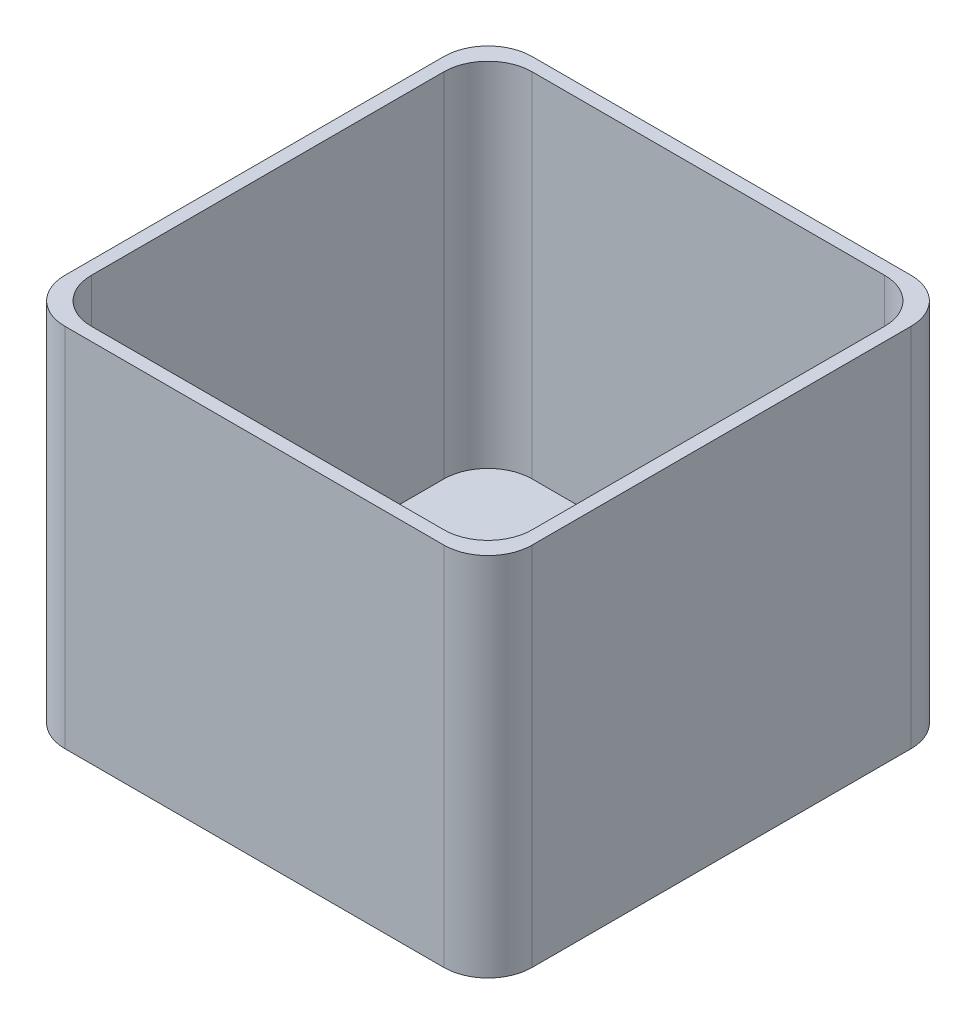
ISO-10303-21;
HEADER;
FILE_DESCRIPTION(('STEP AP214'),'2;1');
FILE_NAME('part.step','',(''),(''),'','','');
FILE_SCHEMA(('AUTOMOTIVE_DESIGN { 1 0 10303 214 1 1 1 1 }'));
ENDSEC;
DATA;
#1=APPLICATION_CONTEXT('core data for automotive mechanical design processes');
#2=APPLICATION_PROTOCOL_DEFINITION('international standard','automotive_design',2000,#1);
#3=PRODUCT_CONTEXT('',#1,'mechanical');
#4=PRODUCT('Part','Part','',(#3));
#5=PRODUCT_RELATED_PRODUCT_CATEGORY('part','',(#4));
#6=PRODUCT_DEFINITION_FORMATION('','',#4);
#7=PRODUCT_DEFINITION_CONTEXT('part definition',#1,'design');
#8=PRODUCT_DEFINITION('design','',#6,#7);
#9=PRODUCT_DEFINITION_SHAPE('','',#8);
#10=(LENGTH_UNIT() NAMED_UNIT(*) SI_UNIT(.MILLI.,.METRE.));
#11=(NAMED_UNIT(*) PLANE_ANGLE_UNIT() SI_UNIT($,.RADIAN.));
#12=(NAMED_UNIT(*) SI_UNIT($,.STERADIAN.) SOLID_ANGLE_UNIT());
#13=UNCERTAINTY_MEASURE_WITH_UNIT(LENGTH_MEASURE(1.E-05),#10,'distance_accuracy_value','');
#14=(GEOMETRIC_REPRESENTATION_CONTEXT(3) GLOBAL_UNCERTAINTY_ASSIGNED_CONTEXT((#13)) GLOBAL_UNIT_ASSIGNED_CONTEXT((#10,
#11,#12)) REPRESENTATION_CONTEXT('',''));
#15=CARTESIAN_POINT('',(0.,0.,0.));
#16=DIRECTION('',(0.,0.,1.));
#17=DIRECTION('',(1.,0.,0.));
#18=AXIS2_PLACEMENT_3D('',#15,#16,#17);
#19=CARTESIAN_POINT('',(0.,80.,-18.3578680203046));
#20=DIRECTION('',(0.,0.,-1.));
#21=DIRECTION('',(-1.,0.,0.));
#22=AXIS2_PLACEMENT_3D('',#19,#20,#21);
#23=PLANE('',#22);
#24=DIRECTION('',(1.,0.,0.));
#25=VECTOR('',#24,1.);
#26=CARTESIAN_POINT('',(0.,0.,-18.3578680203046));
#27=LINE('',#26,#25);
#28=CARTESIAN_POINT('',(-70.8781725888324,0.,-18.3578680203046));
#29=VERTEX_POINT('',#28);
#30=CARTESIAN_POINT('',(9.12182741116744,0.,-18.3578680203046));
#31=VERTEX_POINT('',#30);
#32=EDGE_CURVE('E206',#29,#31,#27,.T.);
#33=ORIENTED_EDGE('',*,*,#32,.T.);
#34=DIRECTION('',(0.,-1.,0.));
#35=VECTOR('',#34,1.);
#36=CARTESIAN_POINT('',(9.12182741116744,80.,-18.3578680203046));
#37=LINE('',#36,#35);
#38=CARTESIAN_POINT('',(9.12182741116744,80.,-18.3578680203046));
#39=VERTEX_POINT('',#38);
#40=EDGE_CURVE('E11',#39,#31,#37,.T.);
#41=ORIENTED_EDGE('',*,*,#40,.F.);
#42=DIRECTION('',(1.,0.,0.));
#43=VECTOR('',#42,1.);
#44=CARTESIAN_POINT('',(0.,80.,-18.3578680203046));
#45=LINE('',#44,#43);
#46=CARTESIAN_POINT('',(-70.8781725888324,80.,-18.3578680203046));
#47=VERTEX_POINT('',#46);
#48=EDGE_CURVE('E237',#47,#39,#45,.T.);
#49=ORIENTED_EDGE('',*,*,#48,.F.);
#50=DIRECTION('',(0.,-1.,0.));
#51=VECTOR('',#50,1.);
#52=CARTESIAN_POINT('',(-70.8781725888324,80.,-18.3578680203046));
#53=LINE('',#52,#51);
#54=EDGE_CURVE('E163',#47,#29,#53,.T.);
#55=ORIENTED_EDGE('',*,*,#54,.T.);
#56=EDGE_LOOP('',(#33,#41,#49,#55));
#57=FACE_BOUND('',#56,.T.);
#58=ADVANCED_FACE('F41',(#57),#23,.F.);
#59=CARTESIAN_POINT('',(9.12182741116751,80.,-8.3578680203046));
#60=DIRECTION('',(0.,-1.,0.));
#61=DIRECTION('',(0.,0.,-1.));
#62=AXIS2_PLACEMENT_3D('',#59,#60,#61);
#63=CYLINDRICAL_SURFACE('',#62,10.);
#64=CARTESIAN_POINT('',(9.12182741116751,0.,-8.3578680203046));
#65=DIRECTION('',(0.,1.,0.));
#66=DIRECTION('',(0.,0.,1.));
#67=AXIS2_PLACEMENT_3D('',#64,#65,#66);
#68=CIRCLE('',#67,10.);
#69=CARTESIAN_POINT('',(19.1218274111675,0.,-8.35786802030453));
#70=VERTEX_POINT('',#69);
#71=EDGE_CURVE('E266',#31,#70,#68,.F.);
#72=ORIENTED_EDGE('',*,*,#71,.T.);
#73=DIRECTION('',(0.,-1.,0.));
#74=VECTOR('',#73,1.);
#75=CARTESIAN_POINT('',(19.1218274111675,80.,-8.35786802030453));
#76=LINE('',#75,#74);
#77=CARTESIAN_POINT('',(19.1218274111675,80.,-8.35786802030453));
#78=VERTEX_POINT('',#77);
#79=EDGE_CURVE('E52',#78,#70,#76,.T.);
#80=ORIENTED_EDGE('',*,*,#79,.F.);
#81=CARTESIAN_POINT('',(9.12182741116751,80.,-8.3578680203046));
#82=DIRECTION('',(0.,1.,0.));
#83=DIRECTION('',(0.,0.,1.));
#84=AXIS2_PLACEMENT_3D('',#81,#82,#83);
#85=CIRCLE('',#84,10.);
#86=EDGE_CURVE('E240',#39,#78,#85,.F.);
#87=ORIENTED_EDGE('',*,*,#86,.F.);
#88=ORIENTED_EDGE('',*,*,#40,.T.);
#89=EDGE_LOOP('',(#72,#80,#87,#88));
#90=FACE_BOUND('',#89,.T.);
#91=ADVANCED_FACE('F370',(#90),#63,.F.);
#92=CARTESIAN_POINT('',(19.1218274111675,80.,0.));
#93=DIRECTION('',(-1.,0.,0.));
#94=DIRECTION('',(0.,0.,1.));
#95=AXIS2_PLACEMENT_3D('',#92,#93,#94);
#96=PLANE('',#95);
#97=DIRECTION('',(0.,0.,-1.));
#98=VECTOR('',#97,1.);
#99=CARTESIAN_POINT('',(19.1218274111675,0.,0.));
#100=LINE('',#99,#98);
#101=CARTESIAN_POINT('',(19.1218274111675,0.,71.6421319796953));
#102=VERTEX_POINT('',#101);
#103=EDGE_CURVE('E270',#102,#70,#100,.T.);
#104=ORIENTED_EDGE('',*,*,#103,.F.);
#105=DIRECTION('',(0.,-1.,0.));
#106=VECTOR('',#105,1.);
#107=CARTESIAN_POINT('',(19.1218274111675,80.,71.6421319796953));
#108=LINE('',#107,#106);
#109=CARTESIAN_POINT('',(19.1218274111675,80.,71.6421319796953));
#110=VERTEX_POINT('',#109);
#111=EDGE_CURVE('E310',#110,#102,#108,.T.);
#112=ORIENTED_EDGE('',*,*,#111,.F.);
#113=DIRECTION('',(0.,0.,-1.));
#114=VECTOR('',#113,1.);
#115=CARTESIAN_POINT('',(19.1218274111675,80.,0.));
#116=LINE('',#115,#114);
#117=EDGE_CURVE('E243',#110,#78,#116,.T.);
#118=ORIENTED_EDGE('',*,*,#117,.T.);
#119=ORIENTED_EDGE('',*,*,#79,.T.);
#120=EDGE_LOOP('',(#104,#112,#118,#119));
#121=FACE_BOUND('',#120,.T.);
#122=ADVANCED_FACE('F376',(#121),#96,.T.);
#123=CARTESIAN_POINT('',(9.12182741116751,80.,71.6421319796954));
#124=DIRECTION('',(0.,-1.,0.));
#125=DIRECTION('',(0.,0.,-1.));
#126=AXIS2_PLACEMENT_3D('',#123,#124,#125);
#127=CYLINDRICAL_SURFACE('',#126,10.);
#128=CARTESIAN_POINT('',(9.12182741116751,0.,71.6421319796954));
#129=DIRECTION('',(0.,1.,0.));
#130=DIRECTION('',(0.,0.,1.));
#131=AXIS2_PLACEMENT_3D('',#128,#129,#130);
#132=CIRCLE('',#131,10.);
#133=CARTESIAN_POINT('',(9.12182741116744,0.,81.6421319796954));
#134=VERTEX_POINT('',#133);
#135=EDGE_CURVE('E274',#134,#102,#132,.T.);
#136=ORIENTED_EDGE('',*,*,#135,.F.);
#137=DIRECTION('',(0.,-1.,0.));
#138=VECTOR('',#137,1.);
#139=CARTESIAN_POINT('',(9.12182741116744,80.,81.6421319796954));
#140=LINE('',#139,#138);
#141=CARTESIAN_POINT('',(9.12182741116744,80.,81.6421319796954));
#142=VERTEX_POINT('',#141);
#143=EDGE_CURVE('E306',#142,#134,#140,.T.);
#144=ORIENTED_EDGE('',*,*,#143,.F.);
#145=CARTESIAN_POINT('',(9.12182741116751,80.,71.6421319796954));
#146=DIRECTION('',(0.,1.,0.));
#147=DIRECTION('',(0.,0.,1.));
#148=AXIS2_PLACEMENT_3D('',#145,#146,#147);
#149=CIRCLE('',#148,10.);
#150=EDGE_CURVE('E247',#142,#110,#149,.T.);
#151=ORIENTED_EDGE('',*,*,#150,.T.);
#152=ORIENTED_EDGE('',*,*,#111,.T.);
#153=EDGE_LOOP('',(#136,#144,#151,#152));
#154=FACE_BOUND('',#153,.T.);
#155=ADVANCED_FACE('F531',(#154),#127,.F.);
#156=CARTESIAN_POINT('',(0.,80.,81.6421319796954));
#157=DIRECTION('',(0.,0.,-1.));
#158=DIRECTION('',(-1.,0.,0.));
#159=AXIS2_PLACEMENT_3D('',#156,#157,#158);
#160=PLANE('',#159);
#161=DIRECTION('',(1.,0.,0.));
#162=VECTOR('',#161,1.);
#163=CARTESIAN_POINT('',(0.,0.,81.6421319796954));
#164=LINE('',#163,#162);
#165=CARTESIAN_POINT('',(-70.8781725888324,0.,81.6421319796954));
#166=VERTEX_POINT('',#165);
#167=EDGE_CURVE('E277',#166,#134,#164,.T.);
#168=ORIENTED_EDGE('',*,*,#167,.F.);
#169=DIRECTION('',(0.,-1.,0.));
#170=VECTOR('',#169,1.);
#171=CARTESIAN_POINT('',(-70.8781725888324,80.,81.6421319796954));
#172=LINE('',#171,#170);
#173=CARTESIAN_POINT('',(-70.8781725888324,80.,81.6421319796954));
#174=VERTEX_POINT('',#173);
#175=EDGE_CURVE('E302',#174,#166,#172,.T.);
#176=ORIENTED_EDGE('',*,*,#175,.F.);
#177=DIRECTION('',(1.,0.,0.));
#178=VECTOR('',#177,1.);
#179=CARTESIAN_POINT('',(0.,80.,81.6421319796954));
#180=LINE('',#179,#178);
#181=EDGE_CURVE('E251',#174,#142,#180,.T.);
#182=ORIENTED_EDGE('',*,*,#181,.T.);
#183=ORIENTED_EDGE('',*,*,#143,.T.);
#184=EDGE_LOOP('',(#168,#176,#182,#183));
#185=FACE_BOUND('',#184,.T.);
#186=ADVANCED_FACE('F521',(#185),#160,.T.);
#187=CARTESIAN_POINT('',(-70.8781725888325,80.,71.6421319796954));
#188=DIRECTION('',(0.,-1.,0.));
#189=DIRECTION('',(0.,0.,-1.));
#190=AXIS2_PLACEMENT_3D('',#187,#188,#189);
#191=CYLINDRICAL_SURFACE('',#190,9.99999999999999);
#192=CARTESIAN_POINT('',(-70.8781725888325,0.,71.6421319796954));
#193=DIRECTION('',(0.,1.,0.));
#194=DIRECTION('',(0.,0.,1.));
#195=AXIS2_PLACEMENT_3D('',#192,#193,#194);
#196=CIRCLE('',#195,9.99999999999999);
#197=CARTESIAN_POINT('',(-80.8781725888325,0.,71.6421319796953));
#198=VERTEX_POINT('',#197);
#199=EDGE_CURVE('E280',#166,#198,#196,.F.);
#200=ORIENTED_EDGE('',*,*,#199,.T.);
#201=DIRECTION('',(0.,-1.,0.));
#202=VECTOR('',#201,1.);
#203=CARTESIAN_POINT('',(-80.8781725888325,80.,71.6421319796953));
#204=LINE('',#203,#202);
#205=CARTESIAN_POINT('',(-80.8781725888325,80.,71.6421319796953));
#206=VERTEX_POINT('',#205);
#207=EDGE_CURVE('E298',#206,#198,#204,.T.);
#208=ORIENTED_EDGE('',*,*,#207,.F.);
#209=CARTESIAN_POINT('',(-70.8781725888325,80.,71.6421319796954));
#210=DIRECTION('',(0.,1.,0.));
#211=DIRECTION('',(0.,0.,1.));
#212=AXIS2_PLACEMENT_3D('',#209,#210,#211);
#213=CIRCLE('',#212,9.99999999999999);
#214=EDGE_CURVE('E255',#174,#206,#213,.F.);
#215=ORIENTED_EDGE('',*,*,#214,.F.);
#216=ORIENTED_EDGE('',*,*,#175,.T.);
#217=EDGE_LOOP('',(#200,#208,#215,#216));
#218=FACE_BOUND('',#217,.T.);
#219=ADVANCED_FACE('F511',(#218),#191,.F.);
#220=CARTESIAN_POINT('',(-80.8781725888325,80.,0.));
#221=DIRECTION('',(-1.,0.,0.));
#222=DIRECTION('',(0.,0.,1.));
#223=AXIS2_PLACEMENT_3D('',#220,#221,#222);
#224=PLANE('',#223);
#225=DIRECTION('',(0.,0.,-1.));
#226=VECTOR('',#225,1.);
#227=CARTESIAN_POINT('',(-80.8781725888325,0.,0.));
#228=LINE('',#227,#226);
#229=CARTESIAN_POINT('',(-80.8781725888325,0.,-8.35786802030452));
#230=VERTEX_POINT('',#229);
#231=EDGE_CURVE('E284',#198,#230,#228,.T.);
#232=ORIENTED_EDGE('',*,*,#231,.T.);
#233=DIRECTION('',(0.,-1.,0.));
#234=VECTOR('',#233,1.);
#235=CARTESIAN_POINT('',(-80.8781725888325,80.,-8.35786802030452));
#236=LINE('',#235,#234);
#237=CARTESIAN_POINT('',(-80.8781725888325,80.,-8.35786802030452));
#238=VERTEX_POINT('',#237);
#239=EDGE_CURVE('E294',#238,#230,#236,.T.);
#240=ORIENTED_EDGE('',*,*,#239,.F.);
#241=DIRECTION('',(0.,0.,-1.));
#242=VECTOR('',#241,1.);
#243=CARTESIAN_POINT('',(-80.8781725888325,80.,0.));
#244=LINE('',#243,#242);
#245=EDGE_CURVE('E258',#206,#238,#244,.T.);
#246=ORIENTED_EDGE('',*,*,#245,.F.);
#247=ORIENTED_EDGE('',*,*,#207,.T.);
#248=EDGE_LOOP('',(#232,#240,#246,#247));
#249=FACE_BOUND('',#248,.T.);
#250=ADVANCED_FACE('F502',(#249),#224,.F.);
#251=CARTESIAN_POINT('',(-73.8781725888325,80.,-11.3578680203046));
#252=DIRECTION('',(0.,-1.,0.));
#253=DIRECTION('',(0.,0.,-1.));
#254=AXIS2_PLACEMENT_3D('',#251,#252,#253);
#255=CYLINDRICAL_SURFACE('',#254,10.);
#256=DIRECTION('',(0.,-1.,0.));
#257=VECTOR('',#256,1.);
#258=CARTESIAN_POINT('',(-73.8781725888324,80.,-21.3578680203046));
#259=LINE('',#258,#257);
#260=CARTESIAN_POINT('',(-73.8781725888324,80.,-21.3578680203046));
#261=VERTEX_POINT('',#260);
#262=CARTESIAN_POINT('',(-73.8781725888324,-3.,-21.3578680203046));
#263=VERTEX_POINT('',#262);
#264=EDGE_CURVE('E167',#261,#263,#259,.T.);
#265=ORIENTED_EDGE('',*,*,#264,.T.);
#266=CARTESIAN_POINT('',(-73.8781725888325,-3.,-11.3578680203046));
#267=DIRECTION('',(0.,-1.,0.));
#268=DIRECTION('',(0.,0.,-1.));
#269=AXIS2_PLACEMENT_3D('',#266,#267,#268);
#270=CIRCLE('',#269,10.);
#271=CARTESIAN_POINT('',(-83.8781725888325,-3.,-11.3578680203045));
#272=VERTEX_POINT('',#271);
#273=EDGE_CURVE('E166',#272,#263,#270,.T.);
#274=ORIENTED_EDGE('',*,*,#273,.F.);
#275=DIRECTION('',(0.,-1.,0.));
#276=VECTOR('',#275,1.);
#277=CARTESIAN_POINT('',(-83.8781725888325,80.,-11.3578680203045));
#278=LINE('',#277,#276);
#279=CARTESIAN_POINT('',(-83.8781725888325,80.,-11.3578680203045));
#280=VERTEX_POINT('',#279);
#281=EDGE_CURVE('E45',#280,#272,#278,.T.);
#282=ORIENTED_EDGE('',*,*,#281,.F.);
#283=CARTESIAN_POINT('',(-73.8781725888325,80.,-11.3578680203046));
#284=DIRECTION('',(0.,1.,0.));
#285=DIRECTION('',(0.,0.,1.));
#286=AXIS2_PLACEMENT_3D('',#283,#284,#285);
#287=CIRCLE('',#286,10.);
#288=EDGE_CURVE('E210',#280,#261,#287,.F.);
#289=ORIENTED_EDGE('',*,*,#288,.T.);
#290=EDGE_LOOP('',(#265,#274,#282,#289));
#291=FACE_BOUND('',#290,.T.);
#292=ADVANCED_FACE('F43',(#291),#255,.T.);
#293=CARTESIAN_POINT('',(-83.8781725888325,80.,0.));
#294=DIRECTION('',(-1.,0.,0.));
#295=DIRECTION('',(0.,0.,1.));
#296=AXIS2_PLACEMENT_3D('',#293,#294,#295);
#297=PLANE('',#296);
#298=ORIENTED_EDGE('',*,*,#281,.T.);
#299=DIRECTION('',(0.,0.,-1.));
#300=VECTOR('',#299,1.);
#301=CARTESIAN_POINT('',(-83.8781725888325,-3.,0.));
#302=LINE('',#301,#300);
#303=CARTESIAN_POINT('',(-83.8781725888325,-3.,74.6421319796953));
#304=VERTEX_POINT('',#303);
#305=EDGE_CURVE('E156',#304,#272,#302,.T.);
#306=ORIENTED_EDGE('',*,*,#305,.F.);
#307=DIRECTION('',(0.,-1.,0.));
#308=VECTOR('',#307,1.);
#309=CARTESIAN_POINT('',(-83.8781725888325,80.,74.6421319796953));
#310=LINE('',#309,#308);
#311=CARTESIAN_POINT('',(-83.8781725888325,80.,74.6421319796953));
#312=VERTEX_POINT('',#311);
#313=EDGE_CURVE('E164',#312,#304,#310,.T.);
#314=ORIENTED_EDGE('',*,*,#313,.F.);
#315=DIRECTION('',(0.,0.,-1.));
#316=VECTOR('',#315,1.);
#317=CARTESIAN_POINT('',(-83.8781725888325,80.,0.));
#318=LINE('',#317,#316);
#319=EDGE_CURVE('E158',#312,#280,#318,.T.);
#320=ORIENTED_EDGE('',*,*,#319,.T.);
#321=EDGE_LOOP('',(#298,#306,#314,#320));
#322=FACE_BOUND('',#321,.T.);
#323=ADVANCED_FACE('F154',(#322),#297,.T.);
#324=CARTESIAN_POINT('',(-73.8781725888325,80.,74.6421319796954));
#325=DIRECTION('',(0.,-1.,0.));
#326=DIRECTION('',(0.,0.,-1.));
#327=AXIS2_PLACEMENT_3D('',#324,#325,#326);
#328=CYLINDRICAL_SURFACE('',#327,9.99999999999999);
#329=ORIENTED_EDGE('',*,*,#313,.T.);
#330=CARTESIAN_POINT('',(-73.8781725888325,-3.,74.6421319796954));
#331=DIRECTION('',(0.,-1.,0.));
#332=DIRECTION('',(0.,0.,-1.));
#333=AXIS2_PLACEMENT_3D('',#330,#331,#332);
#334=CIRCLE('',#333,9.99999999999999);
#335=CARTESIAN_POINT('',(-73.8781725888324,-3.,84.6421319796954));
#336=VERTEX_POINT('',#335);
#337=EDGE_CURVE('E178',#336,#304,#334,.T.);
#338=ORIENTED_EDGE('',*,*,#337,.F.);
#339=DIRECTION('',(0.,-1.,0.));
#340=VECTOR('',#339,1.);
#341=CARTESIAN_POINT('',(-73.8781725888324,80.,84.6421319796954));
#342=LINE('',#341,#340);
#343=CARTESIAN_POINT('',(-73.8781725888324,80.,84.6421319796954));
#344=VERTEX_POINT('',#343);
#345=EDGE_CURVE('E331',#344,#336,#342,.T.);
#346=ORIENTED_EDGE('',*,*,#345,.F.);
#347=CARTESIAN_POINT('',(-73.8781725888325,80.,74.6421319796954));
#348=DIRECTION('',(0.,1.,0.));
#349=DIRECTION('',(0.,0.,1.));
#350=AXIS2_PLACEMENT_3D('',#347,#348,#349);
#351=CIRCLE('',#350,9.99999999999999);
#352=EDGE_CURVE('E216',#344,#312,#351,.F.);
#353=ORIENTED_EDGE('',*,*,#352,.T.);
#354=EDGE_LOOP('',(#329,#338,#346,#353));
#355=FACE_BOUND('',#354,.T.);
#356=ADVANCED_FACE('F335',(#355),#328,.T.);
#357=CARTESIAN_POINT('',(0.,80.,84.6421319796954));
#358=DIRECTION('',(0.,0.,-1.));
#359=DIRECTION('',(-1.,0.,0.));
#360=AXIS2_PLACEMENT_3D('',#357,#358,#359);
#361=PLANE('',#360);
#362=ORIENTED_EDGE('',*,*,#345,.T.);
#363=DIRECTION('',(-1.,0.,0.));
#364=VECTOR('',#363,1.);
#365=CARTESIAN_POINT('',(0.,-3.,84.6421319796954));
#366=LINE('',#365,#364);
#367=CARTESIAN_POINT('',(12.1218274111674,-3.,84.6421319796954));
#368=VERTEX_POINT('',#367);
#369=EDGE_CURVE('E201',#368,#336,#366,.T.);
#370=ORIENTED_EDGE('',*,*,#369,.F.);
#371=DIRECTION('',(0.,-1.,0.));
#372=VECTOR('',#371,1.);
#373=CARTESIAN_POINT('',(12.1218274111674,80.,84.6421319796954));
#374=LINE('',#373,#372);
#375=CARTESIAN_POINT('',(12.1218274111674,80.,84.6421319796954));
#376=VERTEX_POINT('',#375);
#377=EDGE_CURVE('E328',#376,#368,#374,.T.);
#378=ORIENTED_EDGE('',*,*,#377,.F.);
#379=DIRECTION('',(1.,0.,0.));
#380=VECTOR('',#379,1.);
#381=CARTESIAN_POINT('',(0.,80.,84.6421319796954));
#382=LINE('',#381,#380);
#383=EDGE_CURVE('E220',#344,#376,#382,.T.);
#384=ORIENTED_EDGE('',*,*,#383,.F.);
#385=EDGE_LOOP('',(#362,#370,#378,#384));
#386=FACE_BOUND('',#385,.T.);
#387=ADVANCED_FACE('F360',(#386),#361,.F.);
#388=CARTESIAN_POINT('',(12.1218274111675,80.,74.6421319796954));
#389=DIRECTION('',(0.,-1.,0.));
#390=DIRECTION('',(0.,0.,-1.));
#391=AXIS2_PLACEMENT_3D('',#388,#389,#390);
#392=CYLINDRICAL_SURFACE('',#391,10.);
#393=ORIENTED_EDGE('',*,*,#377,.T.);
#394=CARTESIAN_POINT('',(12.1218274111675,-3.,74.6421319796954));
#395=DIRECTION('',(0.,-1.,0.));
#396=DIRECTION('',(0.,0.,-1.));
#397=AXIS2_PLACEMENT_3D('',#394,#395,#396);
#398=CIRCLE('',#397,10.);
#399=CARTESIAN_POINT('',(22.1218274111675,-3.,74.6421319796953));
#400=VERTEX_POINT('',#399);
#401=EDGE_CURVE('E197',#400,#368,#398,.T.);
#402=ORIENTED_EDGE('',*,*,#401,.F.);
#403=DIRECTION('',(0.,-1.,0.));
#404=VECTOR('',#403,1.);
#405=CARTESIAN_POINT('',(22.1218274111675,80.,74.6421319796953));
#406=LINE('',#405,#404);
#407=CARTESIAN_POINT('',(22.1218274111675,80.,74.6421319796953));
#408=VERTEX_POINT('',#407);
#409=EDGE_CURVE('E325',#408,#400,#406,.T.);
#410=ORIENTED_EDGE('',*,*,#409,.F.);
#411=CARTESIAN_POINT('',(12.1218274111675,80.,74.6421319796954));
#412=DIRECTION('',(0.,1.,0.));
#413=DIRECTION('',(0.,0.,1.));
#414=AXIS2_PLACEMENT_3D('',#411,#412,#413);
#415=CIRCLE('',#414,10.);
#416=EDGE_CURVE('E223',#376,#408,#415,.T.);
#417=ORIENTED_EDGE('',*,*,#416,.F.);
#418=EDGE_LOOP('',(#393,#402,#410,#417));
#419=FACE_BOUND('',#418,.T.);
#420=ADVANCED_FACE('F355',(#419),#392,.T.);
#421=CARTESIAN_POINT('',(22.1218274111675,80.,0.));
#422=DIRECTION('',(-1.,0.,0.));
#423=DIRECTION('',(0.,0.,1.));
#424=AXIS2_PLACEMENT_3D('',#421,#422,#423);
#425=PLANE('',#424);
#426=ORIENTED_EDGE('',*,*,#409,.T.);
#427=DIRECTION('',(0.,0.,1.));
#428=VECTOR('',#427,1.);
#429=CARTESIAN_POINT('',(22.1218274111675,-3.,0.));
#430=LINE('',#429,#428);
#431=CARTESIAN_POINT('',(22.1218274111675,-3.,-11.3578680203045));
#432=VERTEX_POINT('',#431);
#433=EDGE_CURVE('E193',#432,#400,#430,.T.);
#434=ORIENTED_EDGE('',*,*,#433,.F.);
#435=DIRECTION('',(0.,-1.,0.));
#436=VECTOR('',#435,1.);
#437=CARTESIAN_POINT('',(22.1218274111675,80.,-11.3578680203045));
#438=LINE('',#437,#436);
#439=CARTESIAN_POINT('',(22.1218274111675,80.,-11.3578680203045));
#440=VERTEX_POINT('',#439);
#441=EDGE_CURVE('E322',#440,#432,#438,.T.);
#442=ORIENTED_EDGE('',*,*,#441,.F.);
#443=DIRECTION('',(0.,0.,-1.));
#444=VECTOR('',#443,1.);
#445=CARTESIAN_POINT('',(22.1218274111675,80.,0.));
#446=LINE('',#445,#444);
#447=EDGE_CURVE('E226',#408,#440,#446,.T.);
#448=ORIENTED_EDGE('',*,*,#447,.F.);
#449=EDGE_LOOP('',(#426,#434,#442,#448));
#450=FACE_BOUND('',#449,.T.);
#451=ADVANCED_FACE('F350',(#450),#425,.F.);
#452=CARTESIAN_POINT('',(12.1218274111675,80.,-11.3578680203046));
#453=DIRECTION('',(0.,-1.,0.));
#454=DIRECTION('',(0.,0.,-1.));
#455=AXIS2_PLACEMENT_3D('',#452,#453,#454);
#456=CYLINDRICAL_SURFACE('',#455,10.);
#457=ORIENTED_EDGE('',*,*,#441,.T.);
#458=CARTESIAN_POINT('',(12.1218274111675,-3.,-11.3578680203046));
#459=DIRECTION('',(0.,-1.,0.));
#460=DIRECTION('',(0.,0.,-1.));
#461=AXIS2_PLACEMENT_3D('',#458,#459,#460);
#462=CIRCLE('',#461,10.);
#463=CARTESIAN_POINT('',(12.1218274111675,-3.,-21.3578680203046));
#464=VERTEX_POINT('',#463);
#465=EDGE_CURVE('E189',#464,#432,#462,.T.);
#466=ORIENTED_EDGE('',*,*,#465,.F.);
#467=DIRECTION('',(0.,-1.,0.));
#468=VECTOR('',#467,1.);
#469=CARTESIAN_POINT('',(12.1218274111674,80.,-21.3578680203046));
#470=LINE('',#469,#468);
#471=CARTESIAN_POINT('',(12.1218274111674,80.,-21.3578680203046));
#472=VERTEX_POINT('',#471);
#473=EDGE_CURVE('E319',#472,#464,#470,.T.);
#474=ORIENTED_EDGE('',*,*,#473,.F.);
#475=CARTESIAN_POINT('',(12.1218274111675,80.,-11.3578680203046));
#476=DIRECTION('',(0.,1.,0.));
#477=DIRECTION('',(0.,0.,1.));
#478=AXIS2_PLACEMENT_3D('',#475,#476,#477);
#479=CIRCLE('',#478,10.);
#480=EDGE_CURVE('E229',#472,#440,#479,.F.);
#481=ORIENTED_EDGE('',*,*,#480,.T.);
#482=EDGE_LOOP('',(#457,#466,#474,#481));
#483=FACE_BOUND('',#482,.T.);
#484=ADVANCED_FACE('F346',(#483),#456,.T.);
#485=CARTESIAN_POINT('',(0.,80.,-21.3578680203046));
#486=DIRECTION('',(0.,0.,-1.));
#487=DIRECTION('',(-1.,0.,0.));
#488=AXIS2_PLACEMENT_3D('',#485,#486,#487);
#489=PLANE('',#488);
#490=ORIENTED_EDGE('',*,*,#473,.T.);
#491=DIRECTION('',(1.,0.,0.));
#492=VECTOR('',#491,1.);
#493=CARTESIAN_POINT('',(0.,-3.,-21.3578680203046));
#494=LINE('',#493,#492);
#495=EDGE_CURVE('E172',#263,#464,#494,.T.);
#496=ORIENTED_EDGE('',*,*,#495,.F.);
#497=ORIENTED_EDGE('',*,*,#264,.F.);
#498=DIRECTION('',(1.,0.,0.));
#499=VECTOR('',#498,1.);
#500=CARTESIAN_POINT('',(0.,80.,-21.3578680203046));
#501=LINE('',#500,#499);
#502=EDGE_CURVE('E233',#261,#472,#501,.T.);
#503=ORIENTED_EDGE('',*,*,#502,.T.);
#504=EDGE_LOOP('',(#490,#496,#497,#503));
#505=FACE_BOUND('',#504,.T.);
#506=ADVANCED_FACE('F342',(#505),#489,.T.);
#507=CARTESIAN_POINT('',(-70.8781725888325,80.,-8.35786802030459));
#508=DIRECTION('',(0.,-1.,0.));
#509=DIRECTION('',(0.,0.,-1.));
#510=AXIS2_PLACEMENT_3D('',#507,#508,#509);
#511=CYLINDRICAL_SURFACE('',#510,10.);
#512=CARTESIAN_POINT('',(-70.8781725888325,0.,-8.35786802030459));
#513=DIRECTION('',(0.,1.,0.));
#514=DIRECTION('',(0.,0.,1.));
#515=AXIS2_PLACEMENT_3D('',#512,#513,#514);
#516=CIRCLE('',#515,10.);
#517=EDGE_CURVE('E213',#230,#29,#516,.F.);
#518=ORIENTED_EDGE('',*,*,#517,.T.);
#519=ORIENTED_EDGE('',*,*,#54,.F.);
#520=CARTESIAN_POINT('',(-70.8781725888325,80.,-8.35786802030459));
#521=DIRECTION('',(0.,1.,0.));
#522=DIRECTION('',(0.,0.,1.));
#523=AXIS2_PLACEMENT_3D('',#520,#521,#522);
#524=CIRCLE('',#523,10.);
#525=EDGE_CURVE('E60',#238,#47,#524,.F.);
#526=ORIENTED_EDGE('',*,*,#525,.F.);
#527=ORIENTED_EDGE('',*,*,#239,.T.);
#528=EDGE_LOOP('',(#518,#519,#526,#527));
#529=FACE_BOUND('',#528,.T.);
#530=ADVANCED_FACE('F383',(#529),#511,.F.);
#531=CARTESIAN_POINT('',(0.,80.,0.));
#532=DIRECTION('',(0.,1.,0.));
#533=DIRECTION('',(0.,0.,1.));
#534=AXIS2_PLACEMENT_3D('',#531,#532,#533);
#535=PLANE('',#534);
#536=ORIENTED_EDGE('',*,*,#288,.F.);
#537=ORIENTED_EDGE('',*,*,#319,.F.);
#538=ORIENTED_EDGE('',*,*,#352,.F.);
#539=ORIENTED_EDGE('',*,*,#383,.T.);
#540=ORIENTED_EDGE('',*,*,#416,.T.);
#541=ORIENTED_EDGE('',*,*,#447,.T.);
#542=ORIENTED_EDGE('',*,*,#480,.F.);
#543=ORIENTED_EDGE('',*,*,#502,.F.);
#544=EDGE_LOOP('',(#536,#537,#538,#539,#540,#541,#542,#543));
#545=FACE_BOUND('',#544,.T.);
#546=ORIENTED_EDGE('',*,*,#48,.T.);
#547=ORIENTED_EDGE('',*,*,#86,.T.);
#548=ORIENTED_EDGE('',*,*,#117,.F.);
#549=ORIENTED_EDGE('',*,*,#150,.F.);
#550=ORIENTED_EDGE('',*,*,#181,.F.);
#551=ORIENTED_EDGE('',*,*,#214,.T.);
#552=ORIENTED_EDGE('',*,*,#245,.T.);
#553=ORIENTED_EDGE('',*,*,#525,.T.);
#554=EDGE_LOOP('',(#546,#547,#548,#549,#550,#551,#552,#553));
#555=FACE_BOUND('',#554,.T.);
#556=ADVANCED_FACE('F338',(#545,#555),#535,.T.);
#557=CARTESIAN_POINT('',(0.,0.,0.));
#558=DIRECTION('',(0.,-1.,0.));
#559=DIRECTION('',(0.,0.,-1.));
#560=AXIS2_PLACEMENT_3D('',#557,#558,#559);
#561=PLANE('',#560);
#562=CARTESIAN_POINT('',(13.968668106839,0.,-4.77801989746901));
#563=DIRECTION('',(0.,-1.,0.));
#564=DIRECTION('',(0.,0.,-1.));
#565=AXIS2_PLACEMENT_3D('',#562,#563,#564);
#566=CIRCLE('',#565,4.77801989746901);
#567=CARTESIAN_POINT('',(13.968668106839,0.,-9.55603979493802));
#568=VERTEX_POINT('',#567);
#569=EDGE_CURVE('E184',#568,#568,#566,.T.);
#570=ORIENTED_EDGE('',*,*,#569,.T.);
#571=EDGE_LOOP('',(#570));
#572=FACE_BOUND('',#571,.T.);
#573=ORIENTED_EDGE('',*,*,#32,.F.);
#574=ORIENTED_EDGE('',*,*,#517,.F.);
#575=ORIENTED_EDGE('',*,*,#231,.F.);
#576=ORIENTED_EDGE('',*,*,#199,.F.);
#577=ORIENTED_EDGE('',*,*,#167,.T.);
#578=ORIENTED_EDGE('',*,*,#135,.T.);
#579=ORIENTED_EDGE('',*,*,#103,.T.);
#580=ORIENTED_EDGE('',*,*,#71,.F.);
#581=EDGE_LOOP('',(#573,#574,#575,#576,#577,#578,#579,#580));
#582=FACE_BOUND('',#581,.T.);
#583=ADVANCED_FACE('F413',(#572,#582),#561,.F.);
#584=CARTESIAN_POINT('',(13.968668106839,-3.,-4.77801989746901));
#585=DIRECTION('',(0.,1.,0.));
#586=DIRECTION('',(0.,0.,1.));
#587=AXIS2_PLACEMENT_3D('',#584,#585,#586);
#588=CYLINDRICAL_SURFACE('',#587,4.77801989746901);
#589=CARTESIAN_POINT('',(13.968668106839,-3.,-4.77801989746901));
#590=DIRECTION('',(0.,-1.,0.));
#591=DIRECTION('',(0.,0.,-1.));
#592=AXIS2_PLACEMENT_3D('',#589,#590,#591);
#593=CIRCLE('',#592,4.77801989746901);
#594=CARTESIAN_POINT('',(13.968668106839,-3.,-9.55603979493802));
#595=VERTEX_POINT('',#594);
#596=EDGE_CURVE('E180',#595,#595,#593,.T.);
#597=ORIENTED_EDGE('',*,*,#596,.T.);
#598=EDGE_LOOP('',(#597));
#599=FACE_BOUND('',#598,.T.);
#600=ORIENTED_EDGE('',*,*,#569,.F.);
#601=EDGE_LOOP('',(#600));
#602=FACE_BOUND('',#601,.T.);
#603=ADVANCED_FACE('F419',(#599,#602),#588,.F.);
#604=CARTESIAN_POINT('',(0.,-3.,0.));
#605=DIRECTION('',(0.,-1.,0.));
#606=DIRECTION('',(0.,0.,-1.));
#607=AXIS2_PLACEMENT_3D('',#604,#605,#606);
#608=PLANE('',#607);
#609=ORIENTED_EDGE('',*,*,#596,.F.);
#610=EDGE_LOOP('',(#609));
#611=FACE_BOUND('',#610,.T.);
#612=ORIENTED_EDGE('',*,*,#305,.T.);
#613=ORIENTED_EDGE('',*,*,#273,.T.);
#614=ORIENTED_EDGE('',*,*,#495,.T.);
#615=ORIENTED_EDGE('',*,*,#465,.T.);
#616=ORIENTED_EDGE('',*,*,#433,.T.);
#617=ORIENTED_EDGE('',*,*,#401,.T.);
#618=ORIENTED_EDGE('',*,*,#369,.T.);
#619=ORIENTED_EDGE('',*,*,#337,.T.);
#620=EDGE_LOOP('',(#612,#613,#614,#615,#616,#617,#618,#619));
#621=FACE_BOUND('',#620,.T.);
#622=ADVANCED_FACE('F175',(#611,#621),#608,.T.);
#623=CLOSED_SHELL('',(#58,#91,#122,#155,#186,#219,#250,#292,#323,#356,#387,#420,#451,#484,#506,
#530,#556,#583,#603,#622));
#624=MANIFOLD_SOLID_BREP('B2',#623);
#625=ADVANCED_BREP_SHAPE_REPRESENTATION('',(#18,#624),#14);
#626=SHAPE_DEFINITION_REPRESENTATION(#9,#625);
ENDSEC;
END-ISO-10303-21;
